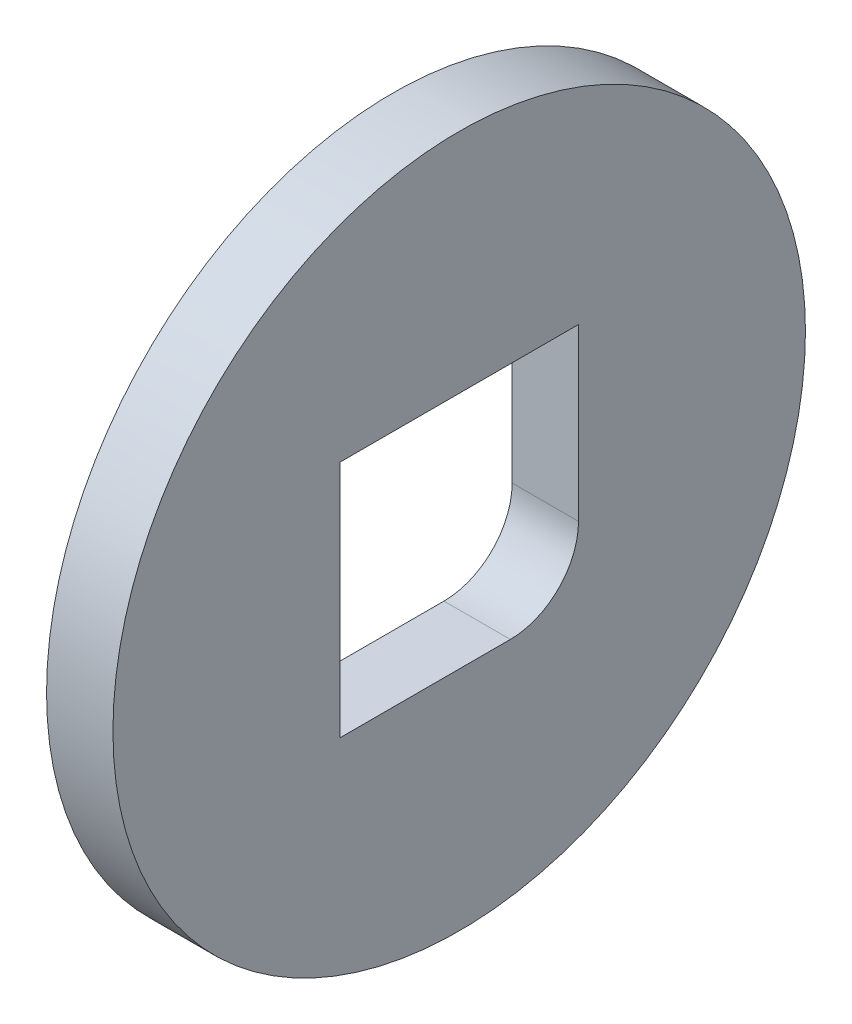
ISO-10303-21;
HEADER;
FILE_DESCRIPTION(('STEP AP214'),'2;1');
FILE_NAME('part.step','',(''),(''),'','','');
FILE_SCHEMA(('AUTOMOTIVE_DESIGN { 1 0 10303 214 1 1 1 1 }'));
ENDSEC;
DATA;
#1=APPLICATION_CONTEXT('core data for automotive mechanical design processes');
#2=APPLICATION_PROTOCOL_DEFINITION('international standard','automotive_design',2000,#1);
#3=PRODUCT_CONTEXT('',#1,'mechanical');
#4=PRODUCT('Part','Part','',(#3));
#5=PRODUCT_RELATED_PRODUCT_CATEGORY('part','',(#4));
#6=PRODUCT_DEFINITION_FORMATION('','',#4);
#7=PRODUCT_DEFINITION_CONTEXT('part definition',#1,'design');
#8=PRODUCT_DEFINITION('design','',#6,#7);
#9=PRODUCT_DEFINITION_SHAPE('','',#8);
#10=(LENGTH_UNIT() NAMED_UNIT(*) SI_UNIT(.MILLI.,.METRE.));
#11=(NAMED_UNIT(*) PLANE_ANGLE_UNIT() SI_UNIT($,.RADIAN.));
#12=(NAMED_UNIT(*) SI_UNIT($,.STERADIAN.) SOLID_ANGLE_UNIT());
#13=UNCERTAINTY_MEASURE_WITH_UNIT(LENGTH_MEASURE(1.E-05),#10,'distance_accuracy_value','');
#14=(GEOMETRIC_REPRESENTATION_CONTEXT(3) GLOBAL_UNCERTAINTY_ASSIGNED_CONTEXT((#13)) GLOBAL_UNIT_ASSIGNED_CONTEXT((#10,
#11,#12)) REPRESENTATION_CONTEXT('',''));
#15=CARTESIAN_POINT('',(0.,0.,0.));
#16=DIRECTION('',(0.,0.,1.));
#17=DIRECTION('',(1.,0.,0.));
#18=AXIS2_PLACEMENT_3D('',#15,#16,#17);
#19=CARTESIAN_POINT('',(0.,0.,0.));
#20=DIRECTION('',(-1.,0.,0.));
#21=DIRECTION('',(0.,0.,1.));
#22=AXIS2_PLACEMENT_3D('',#19,#20,#21);
#23=PLANE('',#22);
#24=DIRECTION('',(0.,-1.,0.));
#25=VECTOR('',#24,1.);
#26=CARTESIAN_POINT('',(0.,17.5,17.5));
#27=LINE('',#26,#25);
#28=CARTESIAN_POINT('',(0.,17.5,17.5));
#29=VERTEX_POINT('',#28);
#30=CARTESIAN_POINT('',(0.,-17.5,17.5));
#31=VERTEX_POINT('',#30);
#32=EDGE_CURVE('E89',#29,#31,#27,.T.);
#33=ORIENTED_EDGE('',*,*,#32,.T.);
#34=DIRECTION('',(0.,0.,-1.));
#35=VECTOR('',#34,1.);
#36=CARTESIAN_POINT('',(0.,-17.5,-17.5));
#37=LINE('',#36,#35);
#38=CARTESIAN_POINT('',(0.,-17.5,-7.5));
#39=VERTEX_POINT('',#38);
#40=EDGE_CURVE('E96',#31,#39,#37,.T.);
#41=ORIENTED_EDGE('',*,*,#40,.T.);
#42=CARTESIAN_POINT('',(0.,-7.5,-7.5));
#43=DIRECTION('',(-1.,0.,0.));
#44=DIRECTION('',(0.,0.,1.));
#45=AXIS2_PLACEMENT_3D('',#42,#43,#44);
#46=CIRCLE('',#45,10.);
#47=CARTESIAN_POINT('',(0.,-7.5,-17.5));
#48=VERTEX_POINT('',#47);
#49=EDGE_CURVE('E11',#39,#48,#46,.F.);
#50=ORIENTED_EDGE('',*,*,#49,.T.);
#51=DIRECTION('',(0.,1.,0.));
#52=VECTOR('',#51,1.);
#53=CARTESIAN_POINT('',(0.,17.5,-17.5));
#54=LINE('',#53,#52);
#55=CARTESIAN_POINT('',(0.,17.5,-17.5));
#56=VERTEX_POINT('',#55);
#57=EDGE_CURVE('E100',#48,#56,#54,.T.);
#58=ORIENTED_EDGE('',*,*,#57,.T.);
#59=DIRECTION('',(0.,0.,1.));
#60=VECTOR('',#59,1.);
#61=CARTESIAN_POINT('',(0.,17.5,-17.5));
#62=LINE('',#61,#60);
#63=EDGE_CURVE('E94',#56,#29,#62,.T.);
#64=ORIENTED_EDGE('',*,*,#63,.T.);
#65=EDGE_LOOP('',(#33,#41,#50,#58,#64));
#66=FACE_BOUND('',#65,.T.);
#67=CARTESIAN_POINT('',(0.,0.,0.));
#68=DIRECTION('',(1.,0.,0.));
#69=DIRECTION('',(0.,0.,-1.));
#70=AXIS2_PLACEMENT_3D('',#67,#68,#69);
#71=CIRCLE('',#70,50.7778745644599);
#72=CARTESIAN_POINT('',(0.,0.,-50.7778745644599));
#73=VERTEX_POINT('',#72);
#74=EDGE_CURVE('E123',#73,#73,#71,.T.);
#75=ORIENTED_EDGE('',*,*,#74,.F.);
#76=EDGE_LOOP('',(#75));
#77=FACE_BOUND('',#76,.T.);
#78=ADVANCED_FACE('F39',(#66,#77),#23,.T.);
#79=CARTESIAN_POINT('',(9.73407566171528,0.,0.));
#80=DIRECTION('',(1.,0.,0.));
#81=DIRECTION('',(0.,0.,-1.));
#82=AXIS2_PLACEMENT_3D('',#79,#80,#81);
#83=CYLINDRICAL_SURFACE('',#82,50.7778745644599);
#84=ORIENTED_EDGE('',*,*,#74,.T.);
#85=EDGE_LOOP('',(#84));
#86=FACE_BOUND('',#85,.T.);
#87=CARTESIAN_POINT('',(9.73407566171528,0.,0.));
#88=DIRECTION('',(1.,0.,0.));
#89=DIRECTION('',(0.,0.,-1.));
#90=AXIS2_PLACEMENT_3D('',#87,#88,#89);
#91=CIRCLE('',#90,50.7778745644599);
#92=CARTESIAN_POINT('',(9.73407566171528,0.,-50.7778745644599));
#93=VERTEX_POINT('',#92);
#94=EDGE_CURVE('E118',#93,#93,#91,.T.);
#95=ORIENTED_EDGE('',*,*,#94,.F.);
#96=EDGE_LOOP('',(#95));
#97=FACE_BOUND('',#96,.T.);
#98=ADVANCED_FACE('F149',(#86,#97),#83,.T.);
#99=CARTESIAN_POINT('',(9.73407566171528,50.7778745644599,0.));
#100=DIRECTION('',(1.,0.,0.));
#101=DIRECTION('',(0.,0.,-1.));
#102=AXIS2_PLACEMENT_3D('',#99,#100,#101);
#103=PLANE('',#102);
#104=DIRECTION('',(0.,-1.,0.));
#105=VECTOR('',#104,1.);
#106=CARTESIAN_POINT('',(9.73407566171528,17.5,17.5));
#107=LINE('',#106,#105);
#108=CARTESIAN_POINT('',(9.73407566171528,17.5,17.5));
#109=VERTEX_POINT('',#108);
#110=CARTESIAN_POINT('',(9.73407566171528,-17.5,17.5));
#111=VERTEX_POINT('',#110);
#112=EDGE_CURVE('E92',#109,#111,#107,.T.);
#113=ORIENTED_EDGE('',*,*,#112,.F.);
#114=DIRECTION('',(0.,0.,1.));
#115=VECTOR('',#114,1.);
#116=CARTESIAN_POINT('',(9.73407566171528,17.5,-17.5));
#117=LINE('',#116,#115);
#118=CARTESIAN_POINT('',(9.73407566171528,17.5,-17.5));
#119=VERTEX_POINT('',#118);
#120=EDGE_CURVE('E104',#119,#109,#117,.T.);
#121=ORIENTED_EDGE('',*,*,#120,.F.);
#122=DIRECTION('',(0.,1.,0.));
#123=VECTOR('',#122,1.);
#124=CARTESIAN_POINT('',(9.73407566171528,17.5,-17.5));
#125=LINE('',#124,#123);
#126=CARTESIAN_POINT('',(9.73407566171528,-7.5,-17.5));
#127=VERTEX_POINT('',#126);
#128=EDGE_CURVE('E107',#127,#119,#125,.T.);
#129=ORIENTED_EDGE('',*,*,#128,.F.);
#130=CARTESIAN_POINT('',(9.73407566171528,-7.5,-7.5));
#131=DIRECTION('',(1.,0.,0.));
#132=DIRECTION('',(0.,0.,-1.));
#133=AXIS2_PLACEMENT_3D('',#130,#131,#132);
#134=CIRCLE('',#133,10.);
#135=CARTESIAN_POINT('',(9.73407566171528,-17.5,-7.5));
#136=VERTEX_POINT('',#135);
#137=EDGE_CURVE('E47',#127,#136,#134,.F.);
#138=ORIENTED_EDGE('',*,*,#137,.T.);
#139=DIRECTION('',(0.,0.,-1.));
#140=VECTOR('',#139,1.);
#141=CARTESIAN_POINT('',(9.73407566171528,-17.5,-17.5));
#142=LINE('',#141,#140);
#143=EDGE_CURVE('E113',#111,#136,#142,.T.);
#144=ORIENTED_EDGE('',*,*,#143,.F.);
#145=EDGE_LOOP('',(#113,#121,#129,#138,#144));
#146=FACE_BOUND('',#145,.T.);
#147=ORIENTED_EDGE('',*,*,#94,.T.);
#148=EDGE_LOOP('',(#147));
#149=FACE_BOUND('',#148,.T.);
#150=ADVANCED_FACE('F136',(#146,#149),#103,.T.);
#151=CARTESIAN_POINT('',(0.,17.5,17.5));
#152=DIRECTION('',(0.,0.,1.));
#153=DIRECTION('',(1.,0.,0.));
#154=AXIS2_PLACEMENT_3D('',#151,#152,#153);
#155=PLANE('',#154);
#156=ORIENTED_EDGE('',*,*,#112,.T.);
#157=DIRECTION('',(1.,0.,0.));
#158=VECTOR('',#157,1.);
#159=CARTESIAN_POINT('',(0.,-17.5,17.5));
#160=LINE('',#159,#158);
#161=EDGE_CURVE('E86',#31,#111,#160,.T.);
#162=ORIENTED_EDGE('',*,*,#161,.F.);
#163=ORIENTED_EDGE('',*,*,#32,.F.);
#164=DIRECTION('',(1.,0.,0.));
#165=VECTOR('',#164,1.);
#166=CARTESIAN_POINT('',(0.,17.5,17.5));
#167=LINE('',#166,#165);
#168=EDGE_CURVE('E116',#29,#109,#167,.T.);
#169=ORIENTED_EDGE('',*,*,#168,.T.);
#170=EDGE_LOOP('',(#156,#162,#163,#169));
#171=FACE_BOUND('',#170,.T.);
#172=ADVANCED_FACE('F87',(#171),#155,.F.);
#173=CARTESIAN_POINT('',(0.,17.5,-17.5));
#174=DIRECTION('',(0.,1.,0.));
#175=DIRECTION('',(0.,0.,1.));
#176=AXIS2_PLACEMENT_3D('',#173,#174,#175);
#177=PLANE('',#176);
#178=ORIENTED_EDGE('',*,*,#120,.T.);
#179=ORIENTED_EDGE('',*,*,#168,.F.);
#180=ORIENTED_EDGE('',*,*,#63,.F.);
#181=DIRECTION('',(1.,0.,0.));
#182=VECTOR('',#181,1.);
#183=CARTESIAN_POINT('',(0.,17.5,-17.5));
#184=LINE('',#183,#182);
#185=EDGE_CURVE('E93',#56,#119,#184,.T.);
#186=ORIENTED_EDGE('',*,*,#185,.T.);
#187=EDGE_LOOP('',(#178,#179,#180,#186));
#188=FACE_BOUND('',#187,.T.);
#189=ADVANCED_FACE('F139',(#188),#177,.F.);
#190=CARTESIAN_POINT('',(0.,17.5,-17.5));
#191=DIRECTION('',(0.,0.,-1.));
#192=DIRECTION('',(-1.,0.,0.));
#193=AXIS2_PLACEMENT_3D('',#190,#191,#192);
#194=PLANE('',#193);
#195=ORIENTED_EDGE('',*,*,#57,.F.);
#196=DIRECTION('',(1.,0.,0.));
#197=VECTOR('',#196,1.);
#198=CARTESIAN_POINT('',(9.73407566171528,-7.5,-17.5));
#199=LINE('',#198,#197);
#200=EDGE_CURVE('E126',#48,#127,#199,.T.);
#201=ORIENTED_EDGE('',*,*,#200,.T.);
#202=ORIENTED_EDGE('',*,*,#128,.T.);
#203=ORIENTED_EDGE('',*,*,#185,.F.);
#204=EDGE_LOOP('',(#195,#201,#202,#203));
#205=FACE_BOUND('',#204,.T.);
#206=ADVANCED_FACE('F132',(#205),#194,.F.);
#207=CARTESIAN_POINT('',(0.,-17.5,-17.5));
#208=DIRECTION('',(0.,-1.,0.));
#209=DIRECTION('',(0.,0.,-1.));
#210=AXIS2_PLACEMENT_3D('',#207,#208,#209);
#211=PLANE('',#210);
#212=ORIENTED_EDGE('',*,*,#143,.T.);
#213=DIRECTION('',(1.,0.,0.));
#214=VECTOR('',#213,1.);
#215=CARTESIAN_POINT('',(0.,-17.5,-7.5));
#216=LINE('',#215,#214);
#217=EDGE_CURVE('E54',#136,#39,#216,.F.);
#218=ORIENTED_EDGE('',*,*,#217,.T.);
#219=ORIENTED_EDGE('',*,*,#40,.F.);
#220=ORIENTED_EDGE('',*,*,#161,.T.);
#221=EDGE_LOOP('',(#212,#218,#219,#220));
#222=FACE_BOUND('',#221,.T.);
#223=ADVANCED_FACE('F97',(#222),#211,.F.);
#224=CARTESIAN_POINT('',(0.,-7.5,-7.5));
#225=DIRECTION('',(-1.,0.,0.));
#226=DIRECTION('',(0.,0.,1.));
#227=AXIS2_PLACEMENT_3D('',#224,#225,#226);
#228=CYLINDRICAL_SURFACE('',#227,10.);
#229=ORIENTED_EDGE('',*,*,#49,.F.);
#230=ORIENTED_EDGE('',*,*,#217,.F.);
#231=ORIENTED_EDGE('',*,*,#137,.F.);
#232=ORIENTED_EDGE('',*,*,#200,.F.);
#233=EDGE_LOOP('',(#229,#230,#231,#232));
#234=FACE_BOUND('',#233,.T.);
#235=ADVANCED_FACE('F41',(#234),#228,.F.);
#236=CLOSED_SHELL('',(#78,#98,#150,#172,#189,#206,#223,#235));
#237=MANIFOLD_SOLID_BREP('B2',#236);
#238=ADVANCED_BREP_SHAPE_REPRESENTATION('',(#18,#237),#14);
#239=SHAPE_DEFINITION_REPRESENTATION(#9,#238);
ENDSEC;
END-ISO-10303-21;
